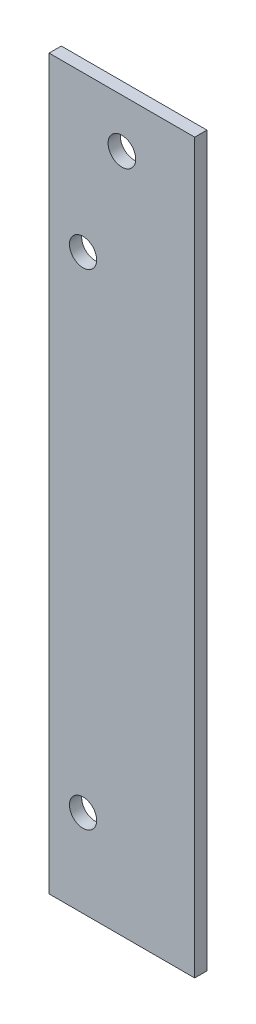
ISO-10303-21;
HEADER;
FILE_DESCRIPTION(('STEP AP214'),'2;1');
FILE_NAME('part.step','',(''),(''),'','','');
FILE_SCHEMA(('AUTOMOTIVE_DESIGN { 1 0 10303 214 1 1 1 1 }'));
ENDSEC;
DATA;
#1=APPLICATION_CONTEXT('core data for automotive mechanical design processes');
#2=APPLICATION_PROTOCOL_DEFINITION('international standard','automotive_design',2000,#1);
#3=PRODUCT_CONTEXT('',#1,'mechanical');
#4=PRODUCT('Part','Part','',(#3));
#5=PRODUCT_RELATED_PRODUCT_CATEGORY('part','',(#4));
#6=PRODUCT_DEFINITION_FORMATION('','',#4);
#7=PRODUCT_DEFINITION_CONTEXT('part definition',#1,'design');
#8=PRODUCT_DEFINITION('design','',#6,#7);
#9=PRODUCT_DEFINITION_SHAPE('','',#8);
#10=(LENGTH_UNIT() NAMED_UNIT(*) SI_UNIT(.MILLI.,.METRE.));
#11=(NAMED_UNIT(*) PLANE_ANGLE_UNIT() SI_UNIT($,.RADIAN.));
#12=(NAMED_UNIT(*) SI_UNIT($,.STERADIAN.) SOLID_ANGLE_UNIT());
#13=UNCERTAINTY_MEASURE_WITH_UNIT(LENGTH_MEASURE(1.E-05),#10,'distance_accuracy_value','');
#14=(GEOMETRIC_REPRESENTATION_CONTEXT(3) GLOBAL_UNCERTAINTY_ASSIGNED_CONTEXT((#13)) GLOBAL_UNIT_ASSIGNED_CONTEXT((#10,
#11,#12)) REPRESENTATION_CONTEXT('',''));
#15=CARTESIAN_POINT('',(0.,0.,0.));
#16=DIRECTION('',(0.,0.,1.));
#17=DIRECTION('',(1.,0.,0.));
#18=AXIS2_PLACEMENT_3D('',#15,#16,#17);
#19=CARTESIAN_POINT('',(0.,0.,1.6002));
#20=DIRECTION('',(1.,0.,0.));
#21=DIRECTION('',(0.,1.,0.));
#22=AXIS2_PLACEMENT_3D('',#19,#20,#21);
#23=PLANE('',#22);
#24=DIRECTION('',(0.,-1.,0.));
#25=VECTOR('',#24,1.);
#26=CARTESIAN_POINT('',(0.,0.,0.));
#27=LINE('',#26,#25);
#28=CARTESIAN_POINT('',(0.,0.,0.));
#29=VERTEX_POINT('',#28);
#30=CARTESIAN_POINT('',(0.,-95.25,0.));
#31=VERTEX_POINT('',#30);
#32=EDGE_CURVE('E70',#29,#31,#27,.T.);
#33=ORIENTED_EDGE('',*,*,#32,.T.);
#34=DIRECTION('',(0.,0.,-1.));
#35=VECTOR('',#34,1.);
#36=CARTESIAN_POINT('',(0.,-95.25,1.6002));
#37=LINE('',#36,#35);
#38=CARTESIAN_POINT('',(0.,-95.25,1.6002));
#39=VERTEX_POINT('',#38);
#40=EDGE_CURVE('E11',#39,#31,#37,.T.);
#41=ORIENTED_EDGE('',*,*,#40,.F.);
#42=DIRECTION('',(0.,-1.,0.));
#43=VECTOR('',#42,1.);
#44=CARTESIAN_POINT('',(0.,0.,1.6002));
#45=LINE('',#44,#43);
#46=CARTESIAN_POINT('',(0.,0.,1.6002));
#47=VERTEX_POINT('',#46);
#48=EDGE_CURVE('E93',#47,#39,#45,.T.);
#49=ORIENTED_EDGE('',*,*,#48,.F.);
#50=DIRECTION('',(0.,0.,-1.));
#51=VECTOR('',#50,1.);
#52=CARTESIAN_POINT('',(0.,0.,1.6002));
#53=LINE('',#52,#51);
#54=EDGE_CURVE('E82',#47,#29,#53,.T.);
#55=ORIENTED_EDGE('',*,*,#54,.T.);
#56=EDGE_LOOP('',(#33,#41,#49,#55));
#57=FACE_BOUND('',#56,.T.);
#58=ADVANCED_FACE('F24',(#57),#23,.F.);
#59=CARTESIAN_POINT('',(0.,-95.25,1.6002));
#60=DIRECTION('',(0.,1.,0.));
#61=DIRECTION('',(0.,0.,1.));
#62=AXIS2_PLACEMENT_3D('',#59,#60,#61);
#63=PLANE('',#62);
#64=DIRECTION('',(1.,0.,0.));
#65=VECTOR('',#64,1.);
#66=CARTESIAN_POINT('',(0.,-95.25,0.));
#67=LINE('',#66,#65);
#68=CARTESIAN_POINT('',(19.05,-95.25,0.));
#69=VERTEX_POINT('',#68);
#70=EDGE_CURVE('E66',#31,#69,#67,.T.);
#71=ORIENTED_EDGE('',*,*,#70,.T.);
#72=DIRECTION('',(0.,0.,-1.));
#73=VECTOR('',#72,1.);
#74=CARTESIAN_POINT('',(19.05,-95.25,1.6002));
#75=LINE('',#74,#73);
#76=CARTESIAN_POINT('',(19.05,-95.25,1.6002));
#77=VERTEX_POINT('',#76);
#78=EDGE_CURVE('E32',#77,#69,#75,.T.);
#79=ORIENTED_EDGE('',*,*,#78,.F.);
#80=DIRECTION('',(1.,0.,0.));
#81=VECTOR('',#80,1.);
#82=CARTESIAN_POINT('',(0.,-95.25,1.6002));
#83=LINE('',#82,#81);
#84=EDGE_CURVE('E78',#39,#77,#83,.T.);
#85=ORIENTED_EDGE('',*,*,#84,.F.);
#86=ORIENTED_EDGE('',*,*,#40,.T.);
#87=EDGE_LOOP('',(#71,#79,#85,#86));
#88=FACE_BOUND('',#87,.T.);
#89=ADVANCED_FACE('F77',(#88),#63,.F.);
#90=CARTESIAN_POINT('',(19.05,0.,1.6002));
#91=DIRECTION('',(-1.,0.,0.));
#92=DIRECTION('',(0.,-1.,0.));
#93=AXIS2_PLACEMENT_3D('',#90,#91,#92);
#94=PLANE('',#93);
#95=DIRECTION('',(0.,1.,0.));
#96=VECTOR('',#95,1.);
#97=CARTESIAN_POINT('',(19.05,0.,0.));
#98=LINE('',#97,#96);
#99=CARTESIAN_POINT('',(19.05,0.,0.));
#100=VERTEX_POINT('',#99);
#101=EDGE_CURVE('E71',#69,#100,#98,.T.);
#102=ORIENTED_EDGE('',*,*,#101,.T.);
#103=DIRECTION('',(0.,0.,-1.));
#104=VECTOR('',#103,1.);
#105=CARTESIAN_POINT('',(19.05,0.,1.6002));
#106=LINE('',#105,#104);
#107=CARTESIAN_POINT('',(19.05,0.,1.6002));
#108=VERTEX_POINT('',#107);
#109=EDGE_CURVE('E99',#108,#100,#106,.T.);
#110=ORIENTED_EDGE('',*,*,#109,.F.);
#111=DIRECTION('',(0.,1.,0.));
#112=VECTOR('',#111,1.);
#113=CARTESIAN_POINT('',(19.05,0.,1.6002));
#114=LINE('',#113,#112);
#115=EDGE_CURVE('E45',#77,#108,#114,.T.);
#116=ORIENTED_EDGE('',*,*,#115,.F.);
#117=ORIENTED_EDGE('',*,*,#78,.T.);
#118=EDGE_LOOP('',(#102,#110,#116,#117));
#119=FACE_BOUND('',#118,.T.);
#120=ADVANCED_FACE('F129',(#119),#94,.F.);
#121=CARTESIAN_POINT('',(0.,0.,1.6002));
#122=DIRECTION('',(0.,-1.,0.));
#123=DIRECTION('',(1.,0.,0.));
#124=AXIS2_PLACEMENT_3D('',#121,#122,#123);
#125=PLANE('',#124);
#126=DIRECTION('',(-1.,0.,0.));
#127=VECTOR('',#126,1.);
#128=CARTESIAN_POINT('',(0.,0.,0.));
#129=LINE('',#128,#127);
#130=EDGE_CURVE('E91',#100,#29,#129,.T.);
#131=ORIENTED_EDGE('',*,*,#130,.T.);
#132=ORIENTED_EDGE('',*,*,#54,.F.);
#133=DIRECTION('',(-1.,0.,0.));
#134=VECTOR('',#133,1.);
#135=CARTESIAN_POINT('',(0.,0.,1.6002));
#136=LINE('',#135,#134);
#137=EDGE_CURVE('E40',#108,#47,#136,.T.);
#138=ORIENTED_EDGE('',*,*,#137,.F.);
#139=ORIENTED_EDGE('',*,*,#109,.T.);
#140=EDGE_LOOP('',(#131,#132,#138,#139));
#141=FACE_BOUND('',#140,.T.);
#142=ADVANCED_FACE('F124',(#141),#125,.F.);
#143=CARTESIAN_POINT('',(0.,0.,1.6002));
#144=DIRECTION('',(0.,0.,1.));
#145=DIRECTION('',(1.,0.,0.));
#146=AXIS2_PLACEMENT_3D('',#143,#144,#145);
#147=PLANE('',#146);
#148=CARTESIAN_POINT('',(4.44499999999999,-83.82,1.6002));
#149=DIRECTION('',(0.,0.,1.));
#150=DIRECTION('',(1.,0.,0.));
#151=AXIS2_PLACEMENT_3D('',#148,#149,#150);
#152=CIRCLE('',#151,1.77799999999999);
#153=CARTESIAN_POINT('',(6.22299999999998,-83.82,1.6002));
#154=VERTEX_POINT('',#153);
#155=EDGE_CURVE('E113',#154,#154,#152,.T.);
#156=ORIENTED_EDGE('',*,*,#155,.F.);
#157=EDGE_LOOP('',(#156));
#158=FACE_BOUND('',#157,.T.);
#159=CARTESIAN_POINT('',(4.445,-20.32,1.6002));
#160=DIRECTION('',(0.,0.,1.));
#161=DIRECTION('',(1.,0.,0.));
#162=AXIS2_PLACEMENT_3D('',#159,#160,#161);
#163=CIRCLE('',#162,1.778);
#164=CARTESIAN_POINT('',(6.223,-20.32,1.6002));
#165=VERTEX_POINT('',#164);
#166=EDGE_CURVE('E104',#165,#165,#163,.T.);
#167=ORIENTED_EDGE('',*,*,#166,.F.);
#168=EDGE_LOOP('',(#167));
#169=FACE_BOUND('',#168,.T.);
#170=CARTESIAN_POINT('',(9.52500000000001,-6.34999999999999,1.6002));
#171=DIRECTION('',(0.,0.,1.));
#172=DIRECTION('',(1.,0.,0.));
#173=AXIS2_PLACEMENT_3D('',#170,#171,#172);
#174=CIRCLE('',#173,1.8034);
#175=CARTESIAN_POINT('',(11.3284,-6.34999999999999,1.6002));
#176=VERTEX_POINT('',#175);
#177=EDGE_CURVE('E86',#176,#176,#174,.T.);
#178=ORIENTED_EDGE('',*,*,#177,.F.);
#179=EDGE_LOOP('',(#178));
#180=FACE_BOUND('',#179,.T.);
#181=ORIENTED_EDGE('',*,*,#48,.T.);
#182=ORIENTED_EDGE('',*,*,#84,.T.);
#183=ORIENTED_EDGE('',*,*,#115,.T.);
#184=ORIENTED_EDGE('',*,*,#137,.T.);
#185=EDGE_LOOP('',(#181,#182,#183,#184));
#186=FACE_BOUND('',#185,.T.);
#187=ADVANCED_FACE('F121',(#158,#169,#180,#186),#147,.T.);
#188=CARTESIAN_POINT('',(0.,0.,0.));
#189=DIRECTION('',(0.,0.,1.));
#190=DIRECTION('',(1.,0.,0.));
#191=AXIS2_PLACEMENT_3D('',#188,#189,#190);
#192=PLANE('',#191);
#193=CARTESIAN_POINT('',(4.44499999999999,-83.82,0.));
#194=DIRECTION('',(0.,0.,1.));
#195=DIRECTION('',(1.,0.,0.));
#196=AXIS2_PLACEMENT_3D('',#193,#194,#195);
#197=CIRCLE('',#196,1.77799999999999);
#198=CARTESIAN_POINT('',(6.22299999999998,-83.82,0.));
#199=VERTEX_POINT('',#198);
#200=EDGE_CURVE('E27',#199,#199,#197,.T.);
#201=ORIENTED_EDGE('',*,*,#200,.T.);
#202=EDGE_LOOP('',(#201));
#203=FACE_BOUND('',#202,.T.);
#204=CARTESIAN_POINT('',(4.445,-20.32,0.));
#205=DIRECTION('',(0.,0.,1.));
#206=DIRECTION('',(1.,0.,0.));
#207=AXIS2_PLACEMENT_3D('',#204,#205,#206);
#208=CIRCLE('',#207,1.778);
#209=CARTESIAN_POINT('',(6.223,-20.32,0.));
#210=VERTEX_POINT('',#209);
#211=EDGE_CURVE('E102',#210,#210,#208,.T.);
#212=ORIENTED_EDGE('',*,*,#211,.T.);
#213=EDGE_LOOP('',(#212));
#214=FACE_BOUND('',#213,.T.);
#215=CARTESIAN_POINT('',(9.52500000000001,-6.34999999999999,0.));
#216=DIRECTION('',(0.,0.,1.));
#217=DIRECTION('',(1.,0.,0.));
#218=AXIS2_PLACEMENT_3D('',#215,#216,#217);
#219=CIRCLE('',#218,1.8034);
#220=CARTESIAN_POINT('',(11.3284,-6.34999999999999,0.));
#221=VERTEX_POINT('',#220);
#222=EDGE_CURVE('E83',#221,#221,#219,.T.);
#223=ORIENTED_EDGE('',*,*,#222,.T.);
#224=EDGE_LOOP('',(#223));
#225=FACE_BOUND('',#224,.T.);
#226=ORIENTED_EDGE('',*,*,#32,.F.);
#227=ORIENTED_EDGE('',*,*,#130,.F.);
#228=ORIENTED_EDGE('',*,*,#101,.F.);
#229=ORIENTED_EDGE('',*,*,#70,.F.);
#230=EDGE_LOOP('',(#226,#227,#228,#229));
#231=FACE_BOUND('',#230,.T.);
#232=ADVANCED_FACE('F67',(#203,#214,#225,#231),#192,.F.);
#233=CARTESIAN_POINT('',(9.52500000000001,-6.34999999999999,0.));
#234=DIRECTION('',(0.,0.,1.));
#235=DIRECTION('',(1.,0.,0.));
#236=AXIS2_PLACEMENT_3D('',#233,#234,#235);
#237=CYLINDRICAL_SURFACE('',#236,1.8034);
#238=ORIENTED_EDGE('',*,*,#222,.F.);
#239=EDGE_LOOP('',(#238));
#240=FACE_BOUND('',#239,.T.);
#241=ORIENTED_EDGE('',*,*,#177,.T.);
#242=EDGE_LOOP('',(#241));
#243=FACE_BOUND('',#242,.T.);
#244=ADVANCED_FACE('F161',(#240,#243),#237,.F.);
#245=CARTESIAN_POINT('',(4.445,-20.32,-0.9398));
#246=DIRECTION('',(0.,0.,1.));
#247=DIRECTION('',(1.,0.,0.));
#248=AXIS2_PLACEMENT_3D('',#245,#246,#247);
#249=CYLINDRICAL_SURFACE('',#248,1.778);
#250=ORIENTED_EDGE('',*,*,#166,.T.);
#251=EDGE_LOOP('',(#250));
#252=FACE_BOUND('',#251,.T.);
#253=ORIENTED_EDGE('',*,*,#211,.F.);
#254=EDGE_LOOP('',(#253));
#255=FACE_BOUND('',#254,.T.);
#256=ADVANCED_FACE('F169',(#252,#255),#249,.F.);
#257=CARTESIAN_POINT('',(4.44499999999999,-83.82,-0.9398));
#258=DIRECTION('',(0.,0.,1.));
#259=DIRECTION('',(1.,0.,0.));
#260=AXIS2_PLACEMENT_3D('',#257,#258,#259);
#261=CYLINDRICAL_SURFACE('',#260,1.77799999999999);
#262=ORIENTED_EDGE('',*,*,#155,.T.);
#263=EDGE_LOOP('',(#262));
#264=FACE_BOUND('',#263,.T.);
#265=ORIENTED_EDGE('',*,*,#200,.F.);
#266=EDGE_LOOP('',(#265));
#267=FACE_BOUND('',#266,.T.);
#268=ADVANCED_FACE('F118',(#264,#267),#261,.F.);
#269=CLOSED_SHELL('',(#58,#89,#120,#142,#187,#232,#244,#256,#268));
#270=MANIFOLD_SOLID_BREP('B2',#269);
#271=ADVANCED_BREP_SHAPE_REPRESENTATION('',(#18,#270),#14);
#272=SHAPE_DEFINITION_REPRESENTATION(#9,#271);
ENDSEC;
END-ISO-10303-21;
